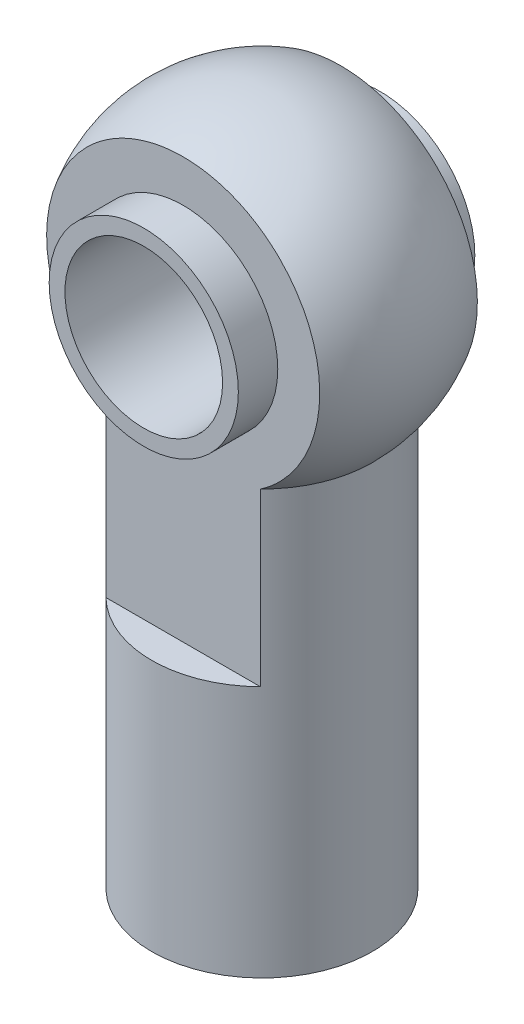
ISO-10303-21;
HEADER;
FILE_DESCRIPTION(('STEP AP214'),'2;1');
FILE_NAME('part.step','',(''),(''),'','','');
FILE_SCHEMA(('AUTOMOTIVE_DESIGN { 1 0 10303 214 1 1 1 1 }'));
ENDSEC;
DATA;
#1=APPLICATION_CONTEXT('core data for automotive mechanical design processes');
#2=APPLICATION_PROTOCOL_DEFINITION('international standard','automotive_design',2000,#1);
#3=PRODUCT_CONTEXT('',#1,'mechanical');
#4=PRODUCT('Part','Part','',(#3));
#5=PRODUCT_RELATED_PRODUCT_CATEGORY('part','',(#4));
#6=PRODUCT_DEFINITION_FORMATION('','',#4);
#7=PRODUCT_DEFINITION_CONTEXT('part definition',#1,'design');
#8=PRODUCT_DEFINITION('design','',#6,#7);
#9=PRODUCT_DEFINITION_SHAPE('','',#8);
#10=(LENGTH_UNIT() NAMED_UNIT(*) SI_UNIT(.MILLI.,.METRE.));
#11=(NAMED_UNIT(*) PLANE_ANGLE_UNIT() SI_UNIT($,.RADIAN.));
#12=(NAMED_UNIT(*) SI_UNIT($,.STERADIAN.) SOLID_ANGLE_UNIT());
#13=UNCERTAINTY_MEASURE_WITH_UNIT(LENGTH_MEASURE(1.E-05),#10,'distance_accuracy_value','');
#14=(GEOMETRIC_REPRESENTATION_CONTEXT(3) GLOBAL_UNCERTAINTY_ASSIGNED_CONTEXT((#13)) GLOBAL_UNIT_ASSIGNED_CONTEXT((#10,
#11,#12)) REPRESENTATION_CONTEXT('',''));
#15=CARTESIAN_POINT('',(0.,0.,0.));
#16=DIRECTION('',(0.,0.,1.));
#17=DIRECTION('',(1.,0.,0.));
#18=AXIS2_PLACEMENT_3D('',#15,#16,#17);
#19=CARTESIAN_POINT('',(0.,0.,2.5));
#20=DIRECTION('',(0.,0.,-1.));
#21=DIRECTION('',(-1.,0.,0.));
#22=AXIS2_PLACEMENT_3D('',#19,#20,#21);
#23=PLANE('',#22);
#24=CARTESIAN_POINT('',(0.,0.,2.5));
#25=DIRECTION('',(0.,0.,-1.));
#26=DIRECTION('',(-1.,0.,0.));
#27=AXIS2_PLACEMENT_3D('',#24,#25,#26);
#28=CIRCLE('',#27,4.33012701892219);
#29=CARTESIAN_POINT('',(-2.44948974278318,-3.57071421427142,2.5));
#30=VERTEX_POINT('',#29);
#31=CARTESIAN_POINT('',(2.44948974278318,-3.57071421427142,2.5));
#32=VERTEX_POINT('',#31);
#33=EDGE_CURVE('E62',#30,#32,#28,.T.);
#34=ORIENTED_EDGE('',*,*,#33,.F.);
#35=DIRECTION('',(0.,-1.,0.));
#36=VECTOR('',#35,1.);
#37=CARTESIAN_POINT('',(-2.44948974278318,0.,2.5));
#38=LINE('',#37,#36);
#39=CARTESIAN_POINT('',(-2.44948974278318,-9.,2.5));
#40=VERTEX_POINT('',#39);
#41=EDGE_CURVE('E102',#40,#30,#38,.F.);
#42=ORIENTED_EDGE('',*,*,#41,.F.);
#43=DIRECTION('',(1.,0.,0.));
#44=VECTOR('',#43,1.);
#45=CARTESIAN_POINT('',(-6.,-9.,2.5));
#46=LINE('',#45,#44);
#47=CARTESIAN_POINT('',(2.44948974278318,-9.,2.5));
#48=VERTEX_POINT('',#47);
#49=EDGE_CURVE('E253',#40,#48,#46,.T.);
#50=ORIENTED_EDGE('',*,*,#49,.T.);
#51=DIRECTION('',(0.,-1.,0.));
#52=VECTOR('',#51,1.);
#53=CARTESIAN_POINT('',(2.44948974278318,0.,2.5));
#54=LINE('',#53,#52);
#55=EDGE_CURVE('E108',#32,#48,#54,.T.);
#56=ORIENTED_EDGE('',*,*,#55,.F.);
#57=EDGE_LOOP('',(#34,#42,#50,#56));
#58=FACE_BOUND('',#57,.T.);
#59=CARTESIAN_POINT('',(0.,0.,2.5));
#60=DIRECTION('',(0.,0.,-1.));
#61=DIRECTION('',(-1.,0.,0.));
#62=AXIS2_PLACEMENT_3D('',#59,#60,#61);
#63=CIRCLE('',#62,3.);
#64=CARTESIAN_POINT('',(-3.,0.,2.5));
#65=VERTEX_POINT('',#64);
#66=EDGE_CURVE('E12',#65,#65,#63,.F.);
#67=ORIENTED_EDGE('',*,*,#66,.F.);
#68=EDGE_LOOP('',(#67));
#69=FACE_BOUND('',#68,.T.);
#70=ADVANCED_FACE('F39',(#58,#69),#23,.F.);
#71=CARTESIAN_POINT('',(0.,0.,-2.5));
#72=DIRECTION('',(0.,0.,1.));
#73=DIRECTION('',(-1.,0.,0.));
#74=AXIS2_PLACEMENT_3D('',#71,#72,#73);
#75=PLANE('',#74);
#76=CARTESIAN_POINT('',(0.,0.,-2.5));
#77=DIRECTION('',(0.,0.,1.));
#78=DIRECTION('',(1.,0.,0.));
#79=AXIS2_PLACEMENT_3D('',#76,#77,#78);
#80=CIRCLE('',#79,4.33012701892219);
#81=CARTESIAN_POINT('',(2.44948974278318,-3.57071421427142,-2.5));
#82=VERTEX_POINT('',#81);
#83=CARTESIAN_POINT('',(-2.44948974278318,-3.57071421427142,-2.5));
#84=VERTEX_POINT('',#83);
#85=EDGE_CURVE('E85',#82,#84,#80,.T.);
#86=ORIENTED_EDGE('',*,*,#85,.F.);
#87=DIRECTION('',(0.,-1.,0.));
#88=VECTOR('',#87,1.);
#89=CARTESIAN_POINT('',(2.44948974278318,0.,-2.5));
#90=LINE('',#89,#88);
#91=CARTESIAN_POINT('',(2.44948974278318,-9.,-2.5));
#92=VERTEX_POINT('',#91);
#93=EDGE_CURVE('E97',#92,#82,#90,.F.);
#94=ORIENTED_EDGE('',*,*,#93,.F.);
#95=DIRECTION('',(1.,0.,0.));
#96=VECTOR('',#95,1.);
#97=CARTESIAN_POINT('',(-6.,-9.,-2.5));
#98=LINE('',#97,#96);
#99=CARTESIAN_POINT('',(-2.44948974278318,-9.,-2.5));
#100=VERTEX_POINT('',#99);
#101=EDGE_CURVE('E54',#100,#92,#98,.T.);
#102=ORIENTED_EDGE('',*,*,#101,.F.);
#103=DIRECTION('',(0.,-1.,0.));
#104=VECTOR('',#103,1.);
#105=CARTESIAN_POINT('',(-2.44948974278318,0.,-2.5));
#106=LINE('',#105,#104);
#107=EDGE_CURVE('E81',#84,#100,#106,.T.);
#108=ORIENTED_EDGE('',*,*,#107,.F.);
#109=EDGE_LOOP('',(#86,#94,#102,#108));
#110=FACE_BOUND('',#109,.T.);
#111=CARTESIAN_POINT('',(0.,0.,-2.5));
#112=DIRECTION('',(0.,0.,1.));
#113=DIRECTION('',(1.,0.,0.));
#114=AXIS2_PLACEMENT_3D('',#111,#112,#113);
#115=CIRCLE('',#114,3.);
#116=CARTESIAN_POINT('',(3.,0.,-2.5));
#117=VERTEX_POINT('',#116);
#118=EDGE_CURVE('E43',#117,#117,#115,.F.);
#119=ORIENTED_EDGE('',*,*,#118,.F.);
#120=EDGE_LOOP('',(#119));
#121=FACE_BOUND('',#120,.T.);
#122=ADVANCED_FACE('F83',(#110,#121),#75,.F.);
#123=CARTESIAN_POINT('',(0.,0.,0.));
#124=DIRECTION('',(0.,-1.,0.));
#125=DIRECTION('',(1.,0.,0.));
#126=AXIS2_PLACEMENT_3D('',#123,#124,#125);
#127=SPHERICAL_SURFACE('',#126,5.);
#128=ORIENTED_EDGE('',*,*,#85,.T.);
#129=CARTESIAN_POINT('',(0.,-3.57071421427142,0.));
#130=DIRECTION('',(0.,-1.,0.));
#131=DIRECTION('',(0.,0.,-1.));
#132=AXIS2_PLACEMENT_3D('',#129,#130,#131);
#133=CIRCLE('',#132,3.5);
#134=EDGE_CURVE('E95',#30,#84,#133,.T.);
#135=ORIENTED_EDGE('',*,*,#134,.F.);
#136=ORIENTED_EDGE('',*,*,#33,.T.);
#137=EDGE_CURVE('E96',#82,#32,#133,.T.);
#138=ORIENTED_EDGE('',*,*,#137,.F.);
#139=EDGE_LOOP('',(#128,#135,#136,#138));
#140=FACE_BOUND('',#139,.T.);
#141=ADVANCED_FACE('F41',(#140),#127,.T.);
#142=CARTESIAN_POINT('',(0.,-7.,0.));
#143=DIRECTION('',(0.,-1.,0.));
#144=DIRECTION('',(0.,0.,-1.));
#145=AXIS2_PLACEMENT_3D('',#142,#143,#144);
#146=PLANE('',#145);
#147=CARTESIAN_POINT('',(0.,-7.,0.));
#148=DIRECTION('',(0.,-1.,0.));
#149=DIRECTION('',(0.,0.,-1.));
#150=AXIS2_PLACEMENT_3D('',#147,#148,#149);
#151=CIRCLE('',#150,1.75);
#152=CARTESIAN_POINT('',(0.,-7.,-1.75));
#153=VERTEX_POINT('',#152);
#154=EDGE_CURVE('E113',#153,#153,#151,.T.);
#155=ORIENTED_EDGE('',*,*,#154,.T.);
#156=EDGE_LOOP('',(#155));
#157=FACE_BOUND('',#156,.T.);
#158=ADVANCED_FACE('F128',(#157),#146,.T.);
#159=CARTESIAN_POINT('',(0.,0.,0.));
#160=DIRECTION('',(0.,-1.,0.));
#161=DIRECTION('',(0.,0.,-1.));
#162=AXIS2_PLACEMENT_3D('',#159,#160,#161);
#163=CYLINDRICAL_SURFACE('',#162,1.75);
#164=CARTESIAN_POINT('',(0.,-17.,0.));
#165=DIRECTION('',(0.,-1.,0.));
#166=DIRECTION('',(0.,0.,-1.));
#167=AXIS2_PLACEMENT_3D('',#164,#165,#166);
#168=CIRCLE('',#167,1.75);
#169=CARTESIAN_POINT('',(0.,-17.,-1.75));
#170=VERTEX_POINT('',#169);
#171=EDGE_CURVE('E106',#170,#170,#168,.T.);
#172=ORIENTED_EDGE('',*,*,#171,.T.);
#173=EDGE_LOOP('',(#172));
#174=FACE_BOUND('',#173,.T.);
#175=ORIENTED_EDGE('',*,*,#154,.F.);
#176=EDGE_LOOP('',(#175));
#177=FACE_BOUND('',#176,.T.);
#178=ADVANCED_FACE('F150',(#174,#177),#163,.F.);
#179=CARTESIAN_POINT('',(1.75,-17.,0.));
#180=DIRECTION('',(0.,-1.,0.));
#181=DIRECTION('',(0.,0.,-1.));
#182=AXIS2_PLACEMENT_3D('',#179,#180,#181);
#183=PLANE('',#182);
#184=CARTESIAN_POINT('',(0.,-17.,0.));
#185=DIRECTION('',(0.,-1.,0.));
#186=DIRECTION('',(0.,0.,-1.));
#187=AXIS2_PLACEMENT_3D('',#184,#185,#186);
#188=CIRCLE('',#187,3.5);
#189=CARTESIAN_POINT('',(0.,-17.,-3.5));
#190=VERTEX_POINT('',#189);
#191=EDGE_CURVE('E103',#190,#190,#188,.T.);
#192=ORIENTED_EDGE('',*,*,#191,.T.);
#193=EDGE_LOOP('',(#192));
#194=FACE_BOUND('',#193,.T.);
#195=ORIENTED_EDGE('',*,*,#171,.F.);
#196=EDGE_LOOP('',(#195));
#197=FACE_BOUND('',#196,.T.);
#198=ADVANCED_FACE('F147',(#194,#197),#183,.T.);
#199=CARTESIAN_POINT('',(0.,0.,0.));
#200=DIRECTION('',(0.,-1.,0.));
#201=DIRECTION('',(0.,0.,-1.));
#202=AXIS2_PLACEMENT_3D('',#199,#200,#201);
#203=CYLINDRICAL_SURFACE('',#202,3.5);
#204=ORIENTED_EDGE('',*,*,#107,.T.);
#205=CARTESIAN_POINT('',(0.,-9.,0.));
#206=DIRECTION('',(0.,-1.,0.));
#207=DIRECTION('',(0.,0.,-1.));
#208=AXIS2_PLACEMENT_3D('',#205,#206,#207);
#209=CIRCLE('',#208,3.5);
#210=EDGE_CURVE('E247',#100,#92,#209,.T.);
#211=ORIENTED_EDGE('',*,*,#210,.T.);
#212=ORIENTED_EDGE('',*,*,#93,.T.);
#213=ORIENTED_EDGE('',*,*,#137,.T.);
#214=ORIENTED_EDGE('',*,*,#55,.T.);
#215=CARTESIAN_POINT('',(0.,-9.,0.));
#216=DIRECTION('',(0.,1.,0.));
#217=DIRECTION('',(0.,0.,1.));
#218=AXIS2_PLACEMENT_3D('',#215,#216,#217);
#219=CIRCLE('',#218,3.5);
#220=EDGE_CURVE('E90',#40,#48,#219,.T.);
#221=ORIENTED_EDGE('',*,*,#220,.F.);
#222=ORIENTED_EDGE('',*,*,#41,.T.);
#223=ORIENTED_EDGE('',*,*,#134,.T.);
#224=EDGE_LOOP('',(#204,#211,#212,#213,#214,#221,#222,#223));
#225=FACE_BOUND('',#224,.T.);
#226=ORIENTED_EDGE('',*,*,#191,.F.);
#227=EDGE_LOOP('',(#226));
#228=FACE_BOUND('',#227,.T.);
#229=ADVANCED_FACE('F99',(#225,#228),#203,.T.);
#230=CARTESIAN_POINT('',(-6.,-9.,4.33112701892219));
#231=DIRECTION('',(0.,1.,0.));
#232=DIRECTION('',(0.,0.,1.));
#233=AXIS2_PLACEMENT_3D('',#230,#231,#232);
#234=PLANE('',#233);
#235=ORIENTED_EDGE('',*,*,#220,.T.);
#236=ORIENTED_EDGE('',*,*,#49,.F.);
#237=EDGE_LOOP('',(#235,#236));
#238=FACE_BOUND('',#237,.T.);
#239=ADVANCED_FACE('F136',(#238),#234,.T.);
#240=CARTESIAN_POINT('',(-6.,-9.,-4.33112701892219));
#241=DIRECTION('',(0.,-1.,0.));
#242=DIRECTION('',(0.,0.,-1.));
#243=AXIS2_PLACEMENT_3D('',#240,#241,#242);
#244=PLANE('',#243);
#245=ORIENTED_EDGE('',*,*,#101,.T.);
#246=ORIENTED_EDGE('',*,*,#210,.F.);
#247=EDGE_LOOP('',(#245,#246));
#248=FACE_BOUND('',#247,.T.);
#249=ADVANCED_FACE('F134',(#248),#244,.F.);
#250=CARTESIAN_POINT('',(0.,0.,3.75));
#251=DIRECTION('',(0.,0.,-1.));
#252=DIRECTION('',(-1.,0.,0.));
#253=AXIS2_PLACEMENT_3D('',#250,#251,#252);
#254=CYLINDRICAL_SURFACE('',#253,3.);
#255=CARTESIAN_POINT('',(0.,0.,-3.75));
#256=DIRECTION('',(0.,0.,1.));
#257=DIRECTION('',(1.,0.,0.));
#258=AXIS2_PLACEMENT_3D('',#255,#256,#257);
#259=CIRCLE('',#258,3.);
#260=CARTESIAN_POINT('',(3.,0.,-3.75));
#261=VERTEX_POINT('',#260);
#262=EDGE_CURVE('E239',#261,#261,#259,.T.);
#263=ORIENTED_EDGE('',*,*,#262,.T.);
#264=EDGE_LOOP('',(#263));
#265=FACE_BOUND('',#264,.T.);
#266=ORIENTED_EDGE('',*,*,#118,.T.);
#267=EDGE_LOOP('',(#266));
#268=FACE_BOUND('',#267,.T.);
#269=ADVANCED_FACE('F120',(#265,#268),#254,.T.);
#270=CARTESIAN_POINT('',(0.,0.,-3.75));
#271=DIRECTION('',(0.,0.,1.));
#272=DIRECTION('',(1.,0.,0.));
#273=AXIS2_PLACEMENT_3D('',#270,#271,#272);
#274=PLANE('',#273);
#275=ORIENTED_EDGE('',*,*,#262,.F.);
#276=EDGE_LOOP('',(#275));
#277=FACE_BOUND('',#276,.T.);
#278=CARTESIAN_POINT('',(0.,0.,-3.75));
#279=DIRECTION('',(0.,0.,1.));
#280=DIRECTION('',(1.,0.,0.));
#281=AXIS2_PLACEMENT_3D('',#278,#279,#280);
#282=CIRCLE('',#281,2.5);
#283=CARTESIAN_POINT('',(2.5,0.,-3.75));
#284=VERTEX_POINT('',#283);
#285=EDGE_CURVE('E240',#284,#284,#282,.T.);
#286=ORIENTED_EDGE('',*,*,#285,.T.);
#287=EDGE_LOOP('',(#286));
#288=FACE_BOUND('',#287,.T.);
#289=ADVANCED_FACE('F143',(#277,#288),#274,.F.);
#290=CARTESIAN_POINT('',(0.,0.,-5.));
#291=DIRECTION('',(0.,0.,1.));
#292=DIRECTION('',(1.,0.,0.));
#293=AXIS2_PLACEMENT_3D('',#290,#291,#292);
#294=CYLINDRICAL_SURFACE('',#293,2.5);
#295=ORIENTED_EDGE('',*,*,#285,.F.);
#296=EDGE_LOOP('',(#295));
#297=FACE_BOUND('',#296,.T.);
#298=CARTESIAN_POINT('',(0.,0.,3.75));
#299=DIRECTION('',(0.,0.,1.));
#300=DIRECTION('',(1.,0.,0.));
#301=AXIS2_PLACEMENT_3D('',#298,#299,#300);
#302=CIRCLE('',#301,2.5);
#303=CARTESIAN_POINT('',(2.5,0.,3.75));
#304=VERTEX_POINT('',#303);
#305=EDGE_CURVE('E237',#304,#304,#302,.T.);
#306=ORIENTED_EDGE('',*,*,#305,.T.);
#307=EDGE_LOOP('',(#306));
#308=FACE_BOUND('',#307,.T.);
#309=ADVANCED_FACE('F140',(#297,#308),#294,.F.);
#310=CARTESIAN_POINT('',(0.,0.,3.75));
#311=DIRECTION('',(0.,0.,1.));
#312=DIRECTION('',(1.,0.,0.));
#313=AXIS2_PLACEMENT_3D('',#310,#311,#312);
#314=CIRCLE('',#313,3.);
#315=CARTESIAN_POINT('',(3.,0.,3.75));
#316=VERTEX_POINT('',#315);
#317=EDGE_CURVE('E234',#316,#316,#314,.T.);
#318=ORIENTED_EDGE('',*,*,#317,.F.);
#319=EDGE_LOOP('',(#318));
#320=FACE_BOUND('',#319,.T.);
#321=ORIENTED_EDGE('',*,*,#66,.T.);
#322=EDGE_LOOP('',(#321));
#323=FACE_BOUND('',#322,.T.);
#324=ADVANCED_FACE('F132',(#320,#323),#254,.T.);
#325=CARTESIAN_POINT('',(0.,0.,3.75));
#326=DIRECTION('',(0.,0.,1.));
#327=DIRECTION('',(1.,0.,0.));
#328=AXIS2_PLACEMENT_3D('',#325,#326,#327);
#329=PLANE('',#328);
#330=ORIENTED_EDGE('',*,*,#317,.T.);
#331=EDGE_LOOP('',(#330));
#332=FACE_BOUND('',#331,.T.);
#333=ORIENTED_EDGE('',*,*,#305,.F.);
#334=EDGE_LOOP('',(#333));
#335=FACE_BOUND('',#334,.T.);
#336=ADVANCED_FACE('F218',(#332,#335),#329,.T.);
#337=CLOSED_SHELL('',(#70,#122,#141,#158,#178,#198,#229,#239,#249,#269,#289,#309,#324,#336));
#338=MANIFOLD_SOLID_BREP('B2',#337);
#339=ADVANCED_BREP_SHAPE_REPRESENTATION('',(#18,#338),#14);
#340=SHAPE_DEFINITION_REPRESENTATION(#9,#339);
ENDSEC;
END-ISO-10303-21;
